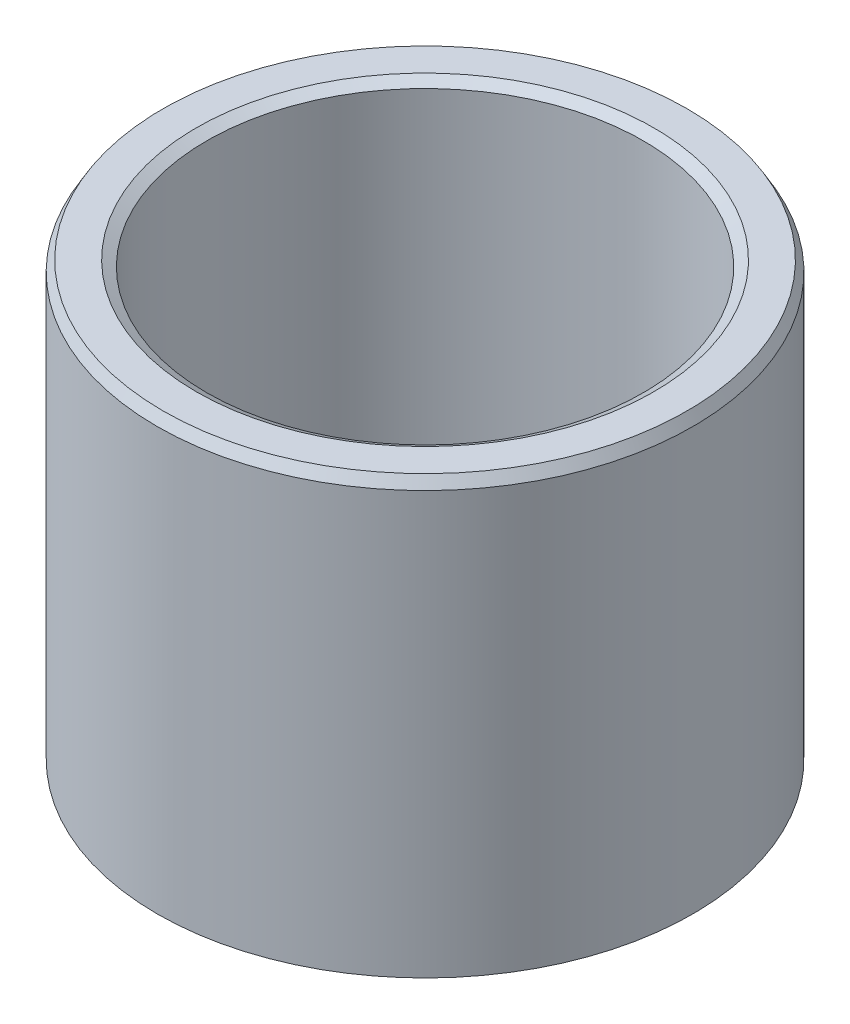
ISO-10303-21;
HEADER;
FILE_DESCRIPTION(('STEP AP214'),'2;1');
FILE_NAME('part.step','',(''),(''),'','','');
FILE_SCHEMA(('AUTOMOTIVE_DESIGN { 1 0 10303 214 1 1 1 1 }'));
ENDSEC;
DATA;
#1=APPLICATION_CONTEXT('core data for automotive mechanical design processes');
#2=APPLICATION_PROTOCOL_DEFINITION('international standard','automotive_design',2000,#1);
#3=PRODUCT_CONTEXT('',#1,'mechanical');
#4=PRODUCT('Part','Part','',(#3));
#5=PRODUCT_RELATED_PRODUCT_CATEGORY('part','',(#4));
#6=PRODUCT_DEFINITION_FORMATION('','',#4);
#7=PRODUCT_DEFINITION_CONTEXT('part definition',#1,'design');
#8=PRODUCT_DEFINITION('design','',#6,#7);
#9=PRODUCT_DEFINITION_SHAPE('','',#8);
#10=(LENGTH_UNIT() NAMED_UNIT(*) SI_UNIT(.MILLI.,.METRE.));
#11=(NAMED_UNIT(*) PLANE_ANGLE_UNIT() SI_UNIT($,.RADIAN.));
#12=(NAMED_UNIT(*) SI_UNIT($,.STERADIAN.) SOLID_ANGLE_UNIT());
#13=UNCERTAINTY_MEASURE_WITH_UNIT(LENGTH_MEASURE(1.E-05),#10,'distance_accuracy_value','');
#14=(GEOMETRIC_REPRESENTATION_CONTEXT(3) GLOBAL_UNCERTAINTY_ASSIGNED_CONTEXT((#13)) GLOBAL_UNIT_ASSIGNED_CONTEXT((#10,
#11,#12)) REPRESENTATION_CONTEXT('',''));
#15=CARTESIAN_POINT('',(0.,0.,0.));
#16=DIRECTION('',(0.,0.,1.));
#17=DIRECTION('',(1.,0.,0.));
#18=AXIS2_PLACEMENT_3D('',#15,#16,#17);
#19=CARTESIAN_POINT('',(0.,53.2000622980721,0.));
#20=DIRECTION('',(0.,-1.,0.));
#21=DIRECTION('',(0.,0.,-1.));
#22=AXIS2_PLACEMENT_3D('',#19,#20,#21);
#23=CYLINDRICAL_SURFACE('',#22,32.5);
#24=CARTESIAN_POINT('',(0.,0.730310097170221,0.));
#25=DIRECTION('',(0.,1.,0.));
#26=DIRECTION('',(0.,0.,1.));
#27=AXIS2_PLACEMENT_3D('',#24,#25,#26);
#28=CIRCLE('',#27,32.5);
#29=CARTESIAN_POINT('',(0.,0.730310097170221,32.5));
#30=VERTEX_POINT('',#29);
#31=EDGE_CURVE('E10',#30,#30,#28,.T.);
#32=ORIENTED_EDGE('',*,*,#31,.T.);
#33=EDGE_LOOP('',(#32));
#34=FACE_BOUND('',#33,.T.);
#35=CARTESIAN_POINT('',(0.,51.9351281044927,0.));
#36=DIRECTION('',(0.,1.,0.));
#37=DIRECTION('',(0.,0.,1.));
#38=AXIS2_PLACEMENT_3D('',#35,#36,#37);
#39=CIRCLE('',#38,32.5);
#40=CARTESIAN_POINT('',(0.,51.9351281044927,32.5));
#41=VERTEX_POINT('',#40);
#42=EDGE_CURVE('E50',#41,#41,#39,.F.);
#43=ORIENTED_EDGE('',*,*,#42,.T.);
#44=EDGE_LOOP('',(#43));
#45=FACE_BOUND('',#44,.T.);
#46=ADVANCED_FACE('F39',(#34,#45),#23,.T.);
#47=CARTESIAN_POINT('',(0.,53.2000622980721,0.));
#48=DIRECTION('',(0.,1.,0.));
#49=DIRECTION('',(0.,0.,1.));
#50=AXIS2_PLACEMENT_3D('',#47,#48,#49);
#51=PLANE('',#50);
#52=CARTESIAN_POINT('',(0.,53.2000622980721,0.));
#53=DIRECTION('',(0.,1.,0.));
#54=DIRECTION('',(0.,0.,1.));
#55=AXIS2_PLACEMENT_3D('',#52,#53,#54);
#56=CIRCLE('',#55,27.7447003489066);
#57=CARTESIAN_POINT('',(0.,53.2000622980721,27.7447003489066));
#58=VERTEX_POINT('',#57);
#59=EDGE_CURVE('E58',#58,#58,#56,.F.);
#60=ORIENTED_EDGE('',*,*,#59,.T.);
#61=EDGE_LOOP('',(#60));
#62=FACE_BOUND('',#61,.T.);
#63=CARTESIAN_POINT('',(0.,53.2000622980721,0.));
#64=DIRECTION('',(0.,1.,0.));
#65=DIRECTION('',(0.,0.,1.));
#66=AXIS2_PLACEMENT_3D('',#63,#64,#65);
#67=CIRCLE('',#66,31.7696899028298);
#68=CARTESIAN_POINT('',(0.,53.2000622980721,31.7696899028298));
#69=VERTEX_POINT('',#68);
#70=EDGE_CURVE('E61',#69,#69,#67,.T.);
#71=ORIENTED_EDGE('',*,*,#70,.T.);
#72=EDGE_LOOP('',(#71));
#73=FACE_BOUND('',#72,.T.);
#74=ADVANCED_FACE('F88',(#62,#73),#51,.T.);
#75=CARTESIAN_POINT('',(0.,0.,0.));
#76=DIRECTION('',(0.,1.,0.));
#77=DIRECTION('',(0.,0.,1.));
#78=AXIS2_PLACEMENT_3D('',#75,#76,#77);
#79=PLANE('',#78);
#80=CARTESIAN_POINT('',(0.,0.,0.));
#81=DIRECTION('',(0.,1.,0.));
#82=DIRECTION('',(0.,0.,1.));
#83=AXIS2_PLACEMENT_3D('',#80,#81,#82);
#84=CIRCLE('',#83,27.2100762524974);
#85=CARTESIAN_POINT('',(0.,0.,27.2100762524974));
#86=VERTEX_POINT('',#85);
#87=EDGE_CURVE('E51',#86,#86,#84,.T.);
#88=ORIENTED_EDGE('',*,*,#87,.T.);
#89=EDGE_LOOP('',(#88));
#90=FACE_BOUND('',#89,.T.);
#91=CARTESIAN_POINT('',(0.,0.,0.));
#92=DIRECTION('',(0.,1.,0.));
#93=DIRECTION('',(0.,0.,1.));
#94=AXIS2_PLACEMENT_3D('',#91,#92,#93);
#95=CIRCLE('',#94,31.2350658064206);
#96=CARTESIAN_POINT('',(0.,0.,31.2350658064206));
#97=VERTEX_POINT('',#96);
#98=EDGE_CURVE('E54',#97,#97,#95,.F.);
#99=ORIENTED_EDGE('',*,*,#98,.T.);
#100=EDGE_LOOP('',(#99));
#101=FACE_BOUND('',#100,.T.);
#102=ADVANCED_FACE('F83',(#90,#101),#79,.F.);
#103=CARTESIAN_POINT('',(0.,53.2000622980721,0.));
#104=DIRECTION('',(0.,-1.,0.));
#105=DIRECTION('',(0.,0.,-1.));
#106=AXIS2_PLACEMENT_3D('',#103,#104,#105);
#107=CYLINDRICAL_SURFACE('',#106,26.4797661553272);
#108=CARTESIAN_POINT('',(0.,52.4697522009019,0.));
#109=DIRECTION('',(0.,1.,0.));
#110=DIRECTION('',(0.,0.,1.));
#111=AXIS2_PLACEMENT_3D('',#108,#109,#110);
#112=CIRCLE('',#111,26.4797661553272);
#113=CARTESIAN_POINT('',(0.,52.4697522009019,26.4797661553272));
#114=VERTEX_POINT('',#113);
#115=EDGE_CURVE('E67',#114,#114,#112,.T.);
#116=ORIENTED_EDGE('',*,*,#115,.T.);
#117=EDGE_LOOP('',(#116));
#118=FACE_BOUND('',#117,.T.);
#119=CARTESIAN_POINT('',(0.,1.2649341935794,0.));
#120=DIRECTION('',(0.,1.,0.));
#121=DIRECTION('',(0.,0.,1.));
#122=AXIS2_PLACEMENT_3D('',#119,#120,#121);
#123=CIRCLE('',#122,26.4797661553272);
#124=CARTESIAN_POINT('',(0.,1.2649341935794,26.4797661553272));
#125=VERTEX_POINT('',#124);
#126=EDGE_CURVE('E69',#125,#125,#123,.F.);
#127=ORIENTED_EDGE('',*,*,#126,.T.);
#128=EDGE_LOOP('',(#127));
#129=FACE_BOUND('',#128,.T.);
#130=ADVANCED_FACE('F71',(#118,#129),#107,.F.);
#131=CARTESIAN_POINT('',(0.,52.4697522009019,0.));
#132=DIRECTION('',(0.,1.,0.));
#133=DIRECTION('',(0.,0.,1.));
#134=AXIS2_PLACEMENT_3D('',#131,#132,#133);
#135=CONICAL_SURFACE('',#134,26.4797661553272,1.0471975511966);
#136=ORIENTED_EDGE('',*,*,#59,.F.);
#137=EDGE_LOOP('',(#136));
#138=FACE_BOUND('',#137,.T.);
#139=ORIENTED_EDGE('',*,*,#115,.F.);
#140=EDGE_LOOP('',(#139));
#141=FACE_BOUND('',#140,.T.);
#142=ADVANCED_FACE('F77',(#138,#141),#135,.F.);
#143=CARTESIAN_POINT('',(0.,0.,0.));
#144=DIRECTION('',(0.,-1.,0.));
#145=DIRECTION('',(0.,0.,-1.));
#146=AXIS2_PLACEMENT_3D('',#143,#144,#145);
#147=CONICAL_SURFACE('',#146,27.2100762524974,0.523598775598293);
#148=ORIENTED_EDGE('',*,*,#126,.F.);
#149=EDGE_LOOP('',(#148));
#150=FACE_BOUND('',#149,.T.);
#151=ORIENTED_EDGE('',*,*,#87,.F.);
#152=EDGE_LOOP('',(#151));
#153=FACE_BOUND('',#152,.T.);
#154=ADVANCED_FACE('F73',(#150,#153),#147,.F.);
#155=CARTESIAN_POINT('',(0.,0.730310097170221,0.));
#156=DIRECTION('',(0.,1.,0.));
#157=DIRECTION('',(0.,0.,1.));
#158=AXIS2_PLACEMENT_3D('',#155,#156,#157);
#159=CONICAL_SURFACE('',#158,32.5,1.0471975511966);
#160=ORIENTED_EDGE('',*,*,#98,.F.);
#161=EDGE_LOOP('',(#160));
#162=FACE_BOUND('',#161,.T.);
#163=ORIENTED_EDGE('',*,*,#31,.F.);
#164=EDGE_LOOP('',(#163));
#165=FACE_BOUND('',#164,.T.);
#166=ADVANCED_FACE('F76',(#162,#165),#159,.T.);
#167=CARTESIAN_POINT('',(0.,53.2000622980721,0.));
#168=DIRECTION('',(0.,-1.,0.));
#169=DIRECTION('',(0.,0.,-1.));
#170=AXIS2_PLACEMENT_3D('',#167,#168,#169);
#171=CONICAL_SURFACE('',#170,31.7696899028298,0.523598775598296);
#172=ORIENTED_EDGE('',*,*,#42,.F.);
#173=EDGE_LOOP('',(#172));
#174=FACE_BOUND('',#173,.T.);
#175=ORIENTED_EDGE('',*,*,#70,.F.);
#176=EDGE_LOOP('',(#175));
#177=FACE_BOUND('',#176,.T.);
#178=ADVANCED_FACE('F45',(#174,#177),#171,.T.);
#179=CLOSED_SHELL('',(#46,#74,#102,#130,#142,#154,#166,#178));
#180=MANIFOLD_SOLID_BREP('B2',#179);
#181=ADVANCED_BREP_SHAPE_REPRESENTATION('',(#18,#180),#14);
#182=SHAPE_DEFINITION_REPRESENTATION(#9,#181);
ENDSEC;
END-ISO-10303-21;
